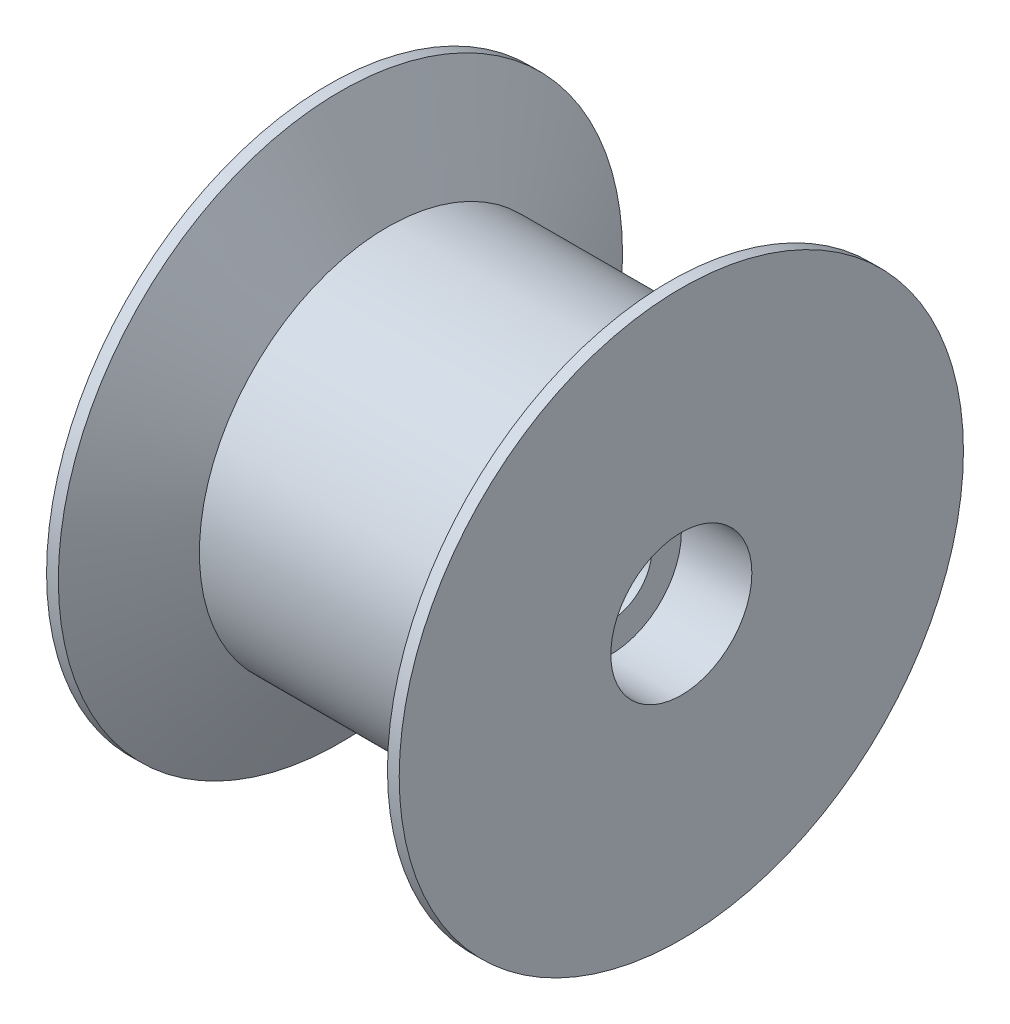
ISO-10303-21;
HEADER;
FILE_DESCRIPTION(('STEP AP214'),'2;1');
FILE_NAME('part.step','',(''),(''),'','','');
FILE_SCHEMA(('AUTOMOTIVE_DESIGN { 1 0 10303 214 1 1 1 1 }'));
ENDSEC;
DATA;
#1=APPLICATION_CONTEXT('core data for automotive mechanical design processes');
#2=APPLICATION_PROTOCOL_DEFINITION('international standard','automotive_design',2000,#1);
#3=PRODUCT_CONTEXT('',#1,'mechanical');
#4=PRODUCT('Part','Part','',(#3));
#5=PRODUCT_RELATED_PRODUCT_CATEGORY('part','',(#4));
#6=PRODUCT_DEFINITION_FORMATION('','',#4);
#7=PRODUCT_DEFINITION_CONTEXT('part definition',#1,'design');
#8=PRODUCT_DEFINITION('design','',#6,#7);
#9=PRODUCT_DEFINITION_SHAPE('','',#8);
#10=(LENGTH_UNIT() NAMED_UNIT(*) SI_UNIT(.MILLI.,.METRE.));
#11=(NAMED_UNIT(*) PLANE_ANGLE_UNIT() SI_UNIT($,.RADIAN.));
#12=(NAMED_UNIT(*) SI_UNIT($,.STERADIAN.) SOLID_ANGLE_UNIT());
#13=UNCERTAINTY_MEASURE_WITH_UNIT(LENGTH_MEASURE(1.E-05),#10,'distance_accuracy_value','');
#14=(GEOMETRIC_REPRESENTATION_CONTEXT(3) GLOBAL_UNCERTAINTY_ASSIGNED_CONTEXT((#13)) GLOBAL_UNIT_ASSIGNED_CONTEXT((#10,
#11,#12)) REPRESENTATION_CONTEXT('',''));
#15=CARTESIAN_POINT('',(0.,0.,0.));
#16=DIRECTION('',(0.,0.,1.));
#17=DIRECTION('',(1.,0.,0.));
#18=AXIS2_PLACEMENT_3D('',#15,#16,#17);
#19=CARTESIAN_POINT('',(7.5,0.,0.));
#20=DIRECTION('',(1.,0.,0.));
#21=DIRECTION('',(0.,0.,-1.));
#22=AXIS2_PLACEMENT_3D('',#19,#20,#21);
#23=PLANE('',#22);
#24=CARTESIAN_POINT('',(7.5,0.,0.));
#25=DIRECTION('',(1.,0.,0.));
#26=DIRECTION('',(0.,0.,-1.));
#27=AXIS2_PLACEMENT_3D('',#24,#25,#26);
#28=CIRCLE('',#27,3.);
#29=CARTESIAN_POINT('',(7.5,0.,-3.));
#30=VERTEX_POINT('',#29);
#31=EDGE_CURVE('E57',#30,#30,#28,.T.);
#32=ORIENTED_EDGE('',*,*,#31,.F.);
#33=EDGE_LOOP('',(#32));
#34=FACE_BOUND('',#33,.T.);
#35=CARTESIAN_POINT('',(7.5,0.,0.));
#36=DIRECTION('',(1.,0.,0.));
#37=DIRECTION('',(0.,0.,-1.));
#38=AXIS2_PLACEMENT_3D('',#35,#36,#37);
#39=CIRCLE('',#38,12.);
#40=CARTESIAN_POINT('',(7.5,0.,-12.));
#41=VERTEX_POINT('',#40);
#42=EDGE_CURVE('E10',#41,#41,#39,.T.);
#43=ORIENTED_EDGE('',*,*,#42,.T.);
#44=EDGE_LOOP('',(#43));
#45=FACE_BOUND('',#44,.T.);
#46=ADVANCED_FACE('F31',(#34,#45),#23,.T.);
#47=CARTESIAN_POINT('',(0.,0.,0.));
#48=DIRECTION('',(1.,0.,0.));
#49=DIRECTION('',(0.,0.,-1.));
#50=AXIS2_PLACEMENT_3D('',#47,#48,#49);
#51=CYLINDRICAL_SURFACE('',#50,12.);
#52=CARTESIAN_POINT('',(7.,0.,0.));
#53=DIRECTION('',(1.,0.,0.));
#54=DIRECTION('',(0.,0.,-1.));
#55=AXIS2_PLACEMENT_3D('',#52,#53,#54);
#56=CIRCLE('',#55,12.);
#57=CARTESIAN_POINT('',(7.,0.,-12.));
#58=VERTEX_POINT('',#57);
#59=EDGE_CURVE('E38',#58,#58,#56,.T.);
#60=ORIENTED_EDGE('',*,*,#59,.T.);
#61=EDGE_LOOP('',(#60));
#62=FACE_BOUND('',#61,.T.);
#63=ORIENTED_EDGE('',*,*,#42,.F.);
#64=EDGE_LOOP('',(#63));
#65=FACE_BOUND('',#64,.T.);
#66=ADVANCED_FACE('F86',(#62,#65),#51,.T.);
#67=CARTESIAN_POINT('',(7.,0.,0.));
#68=DIRECTION('',(1.,0.,0.));
#69=DIRECTION('',(0.,0.,-1.));
#70=AXIS2_PLACEMENT_3D('',#67,#68,#69);
#71=CONICAL_SURFACE('',#70,12.,1.10714871779409);
#72=CARTESIAN_POINT('',(5.,0.,0.));
#73=DIRECTION('',(1.,0.,0.));
#74=DIRECTION('',(0.,0.,-1.));
#75=AXIS2_PLACEMENT_3D('',#72,#73,#74);
#76=CIRCLE('',#75,8.);
#77=CARTESIAN_POINT('',(5.,0.,-8.));
#78=VERTEX_POINT('',#77);
#79=EDGE_CURVE('E42',#78,#78,#76,.T.);
#80=ORIENTED_EDGE('',*,*,#79,.T.);
#81=EDGE_LOOP('',(#80));
#82=FACE_BOUND('',#81,.T.);
#83=ORIENTED_EDGE('',*,*,#59,.F.);
#84=EDGE_LOOP('',(#83));
#85=FACE_BOUND('',#84,.T.);
#86=ADVANCED_FACE('F90',(#82,#85),#71,.T.);
#87=CARTESIAN_POINT('',(0.,0.,0.));
#88=DIRECTION('',(1.,0.,0.));
#89=DIRECTION('',(0.,0.,-1.));
#90=AXIS2_PLACEMENT_3D('',#87,#88,#89);
#91=CYLINDRICAL_SURFACE('',#90,8.);
#92=CARTESIAN_POINT('',(-5.,0.,0.));
#93=DIRECTION('',(1.,0.,0.));
#94=DIRECTION('',(0.,0.,-1.));
#95=AXIS2_PLACEMENT_3D('',#92,#93,#94);
#96=CIRCLE('',#95,8.);
#97=CARTESIAN_POINT('',(-5.,0.,-8.));
#98=VERTEX_POINT('',#97);
#99=EDGE_CURVE('E47',#98,#98,#96,.T.);
#100=ORIENTED_EDGE('',*,*,#99,.T.);
#101=EDGE_LOOP('',(#100));
#102=FACE_BOUND('',#101,.T.);
#103=ORIENTED_EDGE('',*,*,#79,.F.);
#104=EDGE_LOOP('',(#103));
#105=FACE_BOUND('',#104,.T.);
#106=ADVANCED_FACE('F95',(#102,#105),#91,.T.);
#107=CARTESIAN_POINT('',(-5.,0.,0.));
#108=DIRECTION('',(-1.,0.,0.));
#109=DIRECTION('',(0.,0.,1.));
#110=AXIS2_PLACEMENT_3D('',#107,#108,#109);
#111=CONICAL_SURFACE('',#110,8.,1.10714871779409);
#112=CARTESIAN_POINT('',(-7.,0.,0.));
#113=DIRECTION('',(1.,0.,0.));
#114=DIRECTION('',(0.,0.,-1.));
#115=AXIS2_PLACEMENT_3D('',#112,#113,#114);
#116=CIRCLE('',#115,12.);
#117=CARTESIAN_POINT('',(-7.,0.,-12.));
#118=VERTEX_POINT('',#117);
#119=EDGE_CURVE('E50',#118,#118,#116,.T.);
#120=ORIENTED_EDGE('',*,*,#119,.T.);
#121=EDGE_LOOP('',(#120));
#122=FACE_BOUND('',#121,.T.);
#123=ORIENTED_EDGE('',*,*,#99,.F.);
#124=EDGE_LOOP('',(#123));
#125=FACE_BOUND('',#124,.T.);
#126=ADVANCED_FACE('F102',(#122,#125),#111,.T.);
#127=CARTESIAN_POINT('',(0.,0.,0.));
#128=DIRECTION('',(1.,0.,0.));
#129=DIRECTION('',(0.,0.,-1.));
#130=AXIS2_PLACEMENT_3D('',#127,#128,#129);
#131=CYLINDRICAL_SURFACE('',#130,12.);
#132=CARTESIAN_POINT('',(-7.5,0.,0.));
#133=DIRECTION('',(1.,0.,0.));
#134=DIRECTION('',(0.,0.,-1.));
#135=AXIS2_PLACEMENT_3D('',#132,#133,#134);
#136=CIRCLE('',#135,12.);
#137=CARTESIAN_POINT('',(-7.5,0.,-12.));
#138=VERTEX_POINT('',#137);
#139=EDGE_CURVE('E53',#138,#138,#136,.T.);
#140=ORIENTED_EDGE('',*,*,#139,.T.);
#141=EDGE_LOOP('',(#140));
#142=FACE_BOUND('',#141,.T.);
#143=ORIENTED_EDGE('',*,*,#119,.F.);
#144=EDGE_LOOP('',(#143));
#145=FACE_BOUND('',#144,.T.);
#146=ADVANCED_FACE('F106',(#142,#145),#131,.T.);
#147=CARTESIAN_POINT('',(-7.5,12.,0.));
#148=DIRECTION('',(-1.,0.,0.));
#149=DIRECTION('',(0.,0.,1.));
#150=AXIS2_PLACEMENT_3D('',#147,#148,#149);
#151=PLANE('',#150);
#152=CARTESIAN_POINT('',(-7.5,0.,0.));
#153=DIRECTION('',(1.,0.,0.));
#154=DIRECTION('',(0.,0.,-1.));
#155=AXIS2_PLACEMENT_3D('',#152,#153,#154);
#156=CIRCLE('',#155,1.75);
#157=CARTESIAN_POINT('',(-7.5,0.,-1.75));
#158=VERTEX_POINT('',#157);
#159=EDGE_CURVE('E62',#158,#158,#156,.T.);
#160=ORIENTED_EDGE('',*,*,#159,.T.);
#161=EDGE_LOOP('',(#160));
#162=FACE_BOUND('',#161,.T.);
#163=ORIENTED_EDGE('',*,*,#139,.F.);
#164=EDGE_LOOP('',(#163));
#165=FACE_BOUND('',#164,.T.);
#166=ADVANCED_FACE('F81',(#162,#165),#151,.T.);
#167=CARTESIAN_POINT('',(4.5,0.,0.));
#168=DIRECTION('',(1.,0.,0.));
#169=DIRECTION('',(0.,0.,-1.));
#170=AXIS2_PLACEMENT_3D('',#167,#168,#169);
#171=CYLINDRICAL_SURFACE('',#170,3.);
#172=CARTESIAN_POINT('',(4.5,0.,0.));
#173=DIRECTION('',(1.,0.,0.));
#174=DIRECTION('',(0.,0.,-1.));
#175=AXIS2_PLACEMENT_3D('',#172,#173,#174);
#176=CIRCLE('',#175,3.);
#177=CARTESIAN_POINT('',(4.5,0.,-3.));
#178=VERTEX_POINT('',#177);
#179=EDGE_CURVE('E56',#178,#178,#176,.T.);
#180=ORIENTED_EDGE('',*,*,#179,.F.);
#181=EDGE_LOOP('',(#180));
#182=FACE_BOUND('',#181,.T.);
#183=ORIENTED_EDGE('',*,*,#31,.T.);
#184=EDGE_LOOP('',(#183));
#185=FACE_BOUND('',#184,.T.);
#186=ADVANCED_FACE('F75',(#182,#185),#171,.F.);
#187=CARTESIAN_POINT('',(4.5,0.,0.));
#188=DIRECTION('',(1.,0.,0.));
#189=DIRECTION('',(0.,0.,-1.));
#190=AXIS2_PLACEMENT_3D('',#187,#188,#189);
#191=PLANE('',#190);
#192=CARTESIAN_POINT('',(4.5,0.,0.));
#193=DIRECTION('',(1.,0.,0.));
#194=DIRECTION('',(0.,0.,-1.));
#195=AXIS2_PLACEMENT_3D('',#192,#193,#194);
#196=CIRCLE('',#195,1.75);
#197=CARTESIAN_POINT('',(4.5,0.,-1.75));
#198=VERTEX_POINT('',#197);
#199=EDGE_CURVE('E34',#198,#198,#196,.T.);
#200=ORIENTED_EDGE('',*,*,#199,.F.);
#201=EDGE_LOOP('',(#200));
#202=FACE_BOUND('',#201,.T.);
#203=ORIENTED_EDGE('',*,*,#179,.T.);
#204=EDGE_LOOP('',(#203));
#205=FACE_BOUND('',#204,.T.);
#206=ADVANCED_FACE('F72',(#202,#205),#191,.T.);
#207=CARTESIAN_POINT('',(-7.5,0.,0.));
#208=DIRECTION('',(1.,0.,0.));
#209=DIRECTION('',(0.,0.,-1.));
#210=AXIS2_PLACEMENT_3D('',#207,#208,#209);
#211=CYLINDRICAL_SURFACE('',#210,1.75);
#212=ORIENTED_EDGE('',*,*,#199,.T.);
#213=EDGE_LOOP('',(#212));
#214=FACE_BOUND('',#213,.T.);
#215=ORIENTED_EDGE('',*,*,#159,.F.);
#216=EDGE_LOOP('',(#215));
#217=FACE_BOUND('',#216,.T.);
#218=ADVANCED_FACE('F69',(#214,#217),#211,.F.);
#219=CLOSED_SHELL('',(#46,#66,#86,#106,#126,#146,#166,#186,#206,#218));
#220=MANIFOLD_SOLID_BREP('B2',#219);
#221=ADVANCED_BREP_SHAPE_REPRESENTATION('',(#18,#220),#14);
#222=SHAPE_DEFINITION_REPRESENTATION(#9,#221);
ENDSEC;
END-ISO-10303-21;
